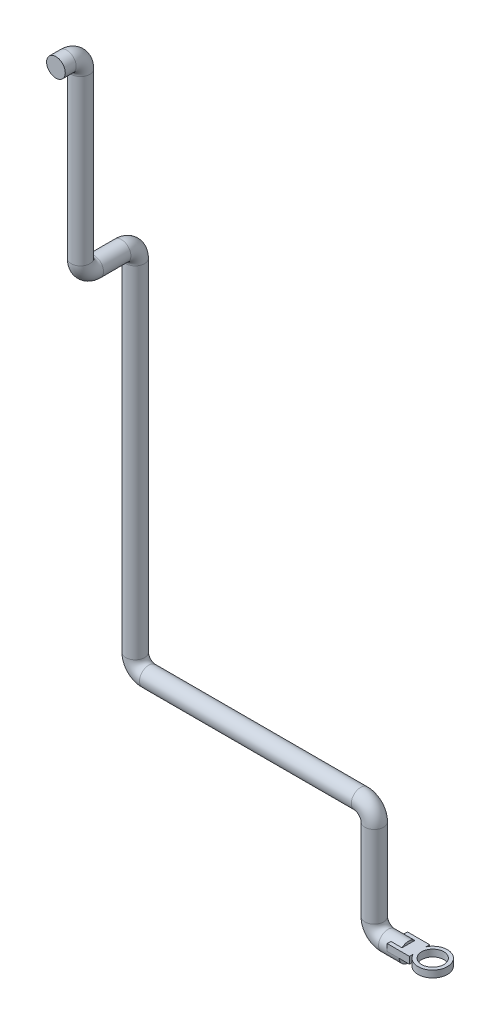
ISO-10303-21;
HEADER;
FILE_DESCRIPTION(('STEP AP214'),'2;1');
FILE_NAME('part.step','',(''),(''),'','','');
FILE_SCHEMA(('AUTOMOTIVE_DESIGN { 1 0 10303 214 1 1 1 1 }'));
ENDSEC;
DATA;
#1=APPLICATION_CONTEXT('core data for automotive mechanical design processes');
#2=APPLICATION_PROTOCOL_DEFINITION('international standard','automotive_design',2000,#1);
#3=PRODUCT_CONTEXT('',#1,'mechanical');
#4=PRODUCT('Part','Part','',(#3));
#5=PRODUCT_RELATED_PRODUCT_CATEGORY('part','',(#4));
#6=PRODUCT_DEFINITION_FORMATION('','',#4);
#7=PRODUCT_DEFINITION_CONTEXT('part definition',#1,'design');
#8=PRODUCT_DEFINITION('design','',#6,#7);
#9=PRODUCT_DEFINITION_SHAPE('','',#8);
#10=(LENGTH_UNIT() NAMED_UNIT(*) SI_UNIT(.MILLI.,.METRE.));
#11=(NAMED_UNIT(*) PLANE_ANGLE_UNIT() SI_UNIT($,.RADIAN.));
#12=(NAMED_UNIT(*) SI_UNIT($,.STERADIAN.) SOLID_ANGLE_UNIT());
#13=UNCERTAINTY_MEASURE_WITH_UNIT(LENGTH_MEASURE(1.E-05),#10,'distance_accuracy_value','');
#14=(GEOMETRIC_REPRESENTATION_CONTEXT(3) GLOBAL_UNCERTAINTY_ASSIGNED_CONTEXT((#13)) GLOBAL_UNIT_ASSIGNED_CONTEXT((#10,
#11,#12)) REPRESENTATION_CONTEXT('',''));
#15=CARTESIAN_POINT('',(0.,0.,0.));
#16=DIRECTION('',(0.,0.,1.));
#17=DIRECTION('',(1.,0.,0.));
#18=AXIS2_PLACEMENT_3D('',#15,#16,#17);
#19=CARTESIAN_POINT('',(0.,0.,0.));
#20=DIRECTION('',(1.,0.,0.));
#21=DIRECTION('',(0.,0.,-1.));
#22=AXIS2_PLACEMENT_3D('',#19,#20,#21);
#23=PLANE('',#22);
#24=CARTESIAN_POINT('',(0.,0.,0.));
#25=DIRECTION('',(1.,0.,0.));
#26=DIRECTION('',(0.,0.,-1.));
#27=AXIS2_PLACEMENT_3D('',#24,#25,#26);
#28=CIRCLE('',#27,13.7);
#29=CARTESIAN_POINT('',(0.,0.,13.7));
#30=VERTEX_POINT('',#29);
#31=CARTESIAN_POINT('',(0.,0.,-13.7));
#32=VERTEX_POINT('',#31);
#33=EDGE_CURVE('E185',#30,#32,#28,.T.);
#34=ORIENTED_EDGE('',*,*,#33,.T.);
#35=DIRECTION('',(0.,0.,1.));
#36=VECTOR('',#35,1.);
#37=CARTESIAN_POINT('',(0.,0.,0.));
#38=LINE('',#37,#36);
#39=EDGE_CURVE('E122',#32,#30,#38,.T.);
#40=ORIENTED_EDGE('',*,*,#39,.T.);
#41=EDGE_LOOP('',(#34,#40));
#42=FACE_BOUND('',#41,.T.);
#43=ADVANCED_FACE('F36',(#42),#23,.T.);
#44=DIRECTION('',(0.,0.,1.));
#45=VECTOR('',#44,1.);
#46=CARTESIAN_POINT('',(0.,10.,0.));
#47=LINE('',#46,#45);
#48=CARTESIAN_POINT('',(0.,10.,-9.36429388688757));
#49=VERTEX_POINT('',#48);
#50=CARTESIAN_POINT('',(0.,10.,9.36429388688757));
#51=VERTEX_POINT('',#50);
#52=EDGE_CURVE('E182',#49,#51,#47,.T.);
#53=ORIENTED_EDGE('',*,*,#52,.F.);
#54=EDGE_CURVE('E188',#49,#51,#28,.T.);
#55=ORIENTED_EDGE('',*,*,#54,.T.);
#56=EDGE_LOOP('',(#53,#55));
#57=FACE_BOUND('',#56,.T.);
#58=ADVANCED_FACE('F38',(#57),#23,.T.);
#59=CARTESIAN_POINT('',(-400.,979.4,116.));
#60=DIRECTION('',(0.,0.,-1.));
#61=DIRECTION('',(0.,1.,0.));
#62=AXIS2_PLACEMENT_3D('',#59,#60,#61);
#63=PLANE('',#62);
#64=CARTESIAN_POINT('',(-400.,979.4,116.));
#65=DIRECTION('',(0.,0.,-1.));
#66=DIRECTION('',(0.,1.,0.));
#67=AXIS2_PLACEMENT_3D('',#64,#65,#66);
#68=CIRCLE('',#67,13.7);
#69=CARTESIAN_POINT('',(-400.,993.1,116.));
#70=VERTEX_POINT('',#69);
#71=EDGE_CURVE('E225',#70,#70,#68,.T.);
#72=ORIENTED_EDGE('',*,*,#71,.F.);
#73=EDGE_LOOP('',(#72));
#74=FACE_BOUND('',#73,.T.);
#75=ADVANCED_FACE('F264',(#74),#63,.F.);
#76=CARTESIAN_POINT('',(0.,0.,0.));
#77=DIRECTION('',(-1.,0.,0.));
#78=DIRECTION('',(0.,0.,1.));
#79=AXIS2_PLACEMENT_3D('',#76,#77,#78);
#80=CYLINDRICAL_SURFACE('',#79,13.7);
#81=CARTESIAN_POINT('',(-30.,0.,0.));
#82=DIRECTION('',(1.,0.,0.));
#83=DIRECTION('',(0.,0.,-1.));
#84=AXIS2_PLACEMENT_3D('',#81,#82,#83);
#85=CIRCLE('',#84,13.7);
#86=CARTESIAN_POINT('',(-30.,-13.7,0.));
#87=VERTEX_POINT('',#86);
#88=EDGE_CURVE('E189',#87,#87,#85,.T.);
#89=ORIENTED_EDGE('',*,*,#88,.T.);
#90=EDGE_LOOP('',(#89));
#91=FACE_BOUND('',#90,.T.);
#92=ORIENTED_EDGE('',*,*,#54,.F.);
#93=DIRECTION('',(-1.,0.,0.));
#94=VECTOR('',#93,1.);
#95=CARTESIAN_POINT('',(0.,10.,-9.36429388688757));
#96=LINE('',#95,#94);
#97=CARTESIAN_POINT('',(-16.2659327761707,10.,-9.36429388688757));
#98=VERTEX_POINT('',#97);
#99=EDGE_CURVE('E11',#49,#98,#96,.T.);
#100=ORIENTED_EDGE('',*,*,#99,.T.);
#101=CARTESIAN_POINT('',(-16.2659327761707,0.,0.));
#102=DIRECTION('',(1.,0.,0.));
#103=DIRECTION('',(0.,0.,-1.));
#104=AXIS2_PLACEMENT_3D('',#101,#102,#103);
#105=CIRCLE('',#104,13.7);
#106=CARTESIAN_POINT('',(-16.2659327761707,0.,-13.7));
#107=VERTEX_POINT('',#106);
#108=EDGE_CURVE('E44',#107,#98,#105,.T.);
#109=ORIENTED_EDGE('',*,*,#108,.F.);
#110=DIRECTION('',(-1.,0.,0.));
#111=VECTOR('',#110,1.);
#112=CARTESIAN_POINT('',(0.,0.,-13.7));
#113=LINE('',#112,#111);
#114=EDGE_CURVE('E234',#32,#107,#113,.T.);
#115=ORIENTED_EDGE('',*,*,#114,.F.);
#116=ORIENTED_EDGE('',*,*,#33,.F.);
#117=DIRECTION('',(-1.,0.,0.));
#118=VECTOR('',#117,1.);
#119=CARTESIAN_POINT('',(0.,0.,13.7));
#120=LINE('',#119,#118);
#121=CARTESIAN_POINT('',(-16.2659327761707,0.,13.7));
#122=VERTEX_POINT('',#121);
#123=EDGE_CURVE('E227',#122,#30,#120,.F.);
#124=ORIENTED_EDGE('',*,*,#123,.F.);
#125=CARTESIAN_POINT('',(-16.2659327761707,10.,9.36429388688757));
#126=VERTEX_POINT('',#125);
#127=EDGE_CURVE('E230',#126,#122,#105,.T.);
#128=ORIENTED_EDGE('',*,*,#127,.F.);
#129=DIRECTION('',(-1.,0.,0.));
#130=VECTOR('',#129,1.);
#131=CARTESIAN_POINT('',(0.,10.,9.36429388688757));
#132=LINE('',#131,#130);
#133=EDGE_CURVE('E233',#126,#51,#132,.F.);
#134=ORIENTED_EDGE('',*,*,#133,.T.);
#135=EDGE_LOOP('',(#92,#100,#109,#115,#116,#124,#128,#134));
#136=FACE_BOUND('',#135,.T.);
#137=ADVANCED_FACE('F281',(#91,#136),#80,.T.);
#138=CARTESIAN_POINT('',(-30.,20.,0.));
#139=DIRECTION('',(0.,0.,-1.));
#140=DIRECTION('',(-1.,0.,0.));
#141=AXIS2_PLACEMENT_3D('',#138,#139,#140);
#142=TOROIDAL_SURFACE('',#141,20.,13.7);
#143=CARTESIAN_POINT('',(-50.,20.,0.));
#144=DIRECTION('',(0.,-1.,0.));
#145=DIRECTION('',(0.,0.,-1.));
#146=AXIS2_PLACEMENT_3D('',#143,#144,#145);
#147=CIRCLE('',#146,13.7);
#148=CARTESIAN_POINT('',(-63.7,20.,0.));
#149=VERTEX_POINT('',#148);
#150=EDGE_CURVE('E192',#149,#149,#147,.T.);
#151=CARTESIAN_POINT('',(-30.,20.,0.));
#152=DIRECTION('',(0.,0.,-1.));
#153=DIRECTION('',(-1.,0.,0.));
#154=AXIS2_PLACEMENT_3D('',#151,#152,#153);
#155=CIRCLE('',#154,33.7);
#156=EDGE_CURVE('',#87,#149,#155,.T.);
#157=ORIENTED_EDGE('',*,*,#88,.F.);
#158=ORIENTED_EDGE('',*,*,#150,.T.);
#159=ORIENTED_EDGE('',*,*,#156,.T.);
#160=ORIENTED_EDGE('',*,*,#156,.F.);
#161=EDGE_LOOP('',(#157,#159,#158,#160));
#162=FACE_BOUND('',#161,.T.);
#163=ADVANCED_FACE('F286',(#162),#142,.T.);
#164=CARTESIAN_POINT('',(-50.,20.,0.));
#165=DIRECTION('',(0.,1.,0.));
#166=DIRECTION('',(0.,0.,1.));
#167=AXIS2_PLACEMENT_3D('',#164,#165,#166);
#168=CYLINDRICAL_SURFACE('',#167,13.7);
#169=CARTESIAN_POINT('',(-50.,140.,0.));
#170=DIRECTION('',(0.,-1.,0.));
#171=DIRECTION('',(0.,0.,-1.));
#172=AXIS2_PLACEMENT_3D('',#169,#170,#171);
#173=CIRCLE('',#172,13.7);
#174=CARTESIAN_POINT('',(-36.3,140.,0.));
#175=VERTEX_POINT('',#174);
#176=EDGE_CURVE('E195',#175,#175,#173,.T.);
#177=ORIENTED_EDGE('',*,*,#176,.T.);
#178=EDGE_LOOP('',(#177));
#179=FACE_BOUND('',#178,.T.);
#180=ORIENTED_EDGE('',*,*,#150,.F.);
#181=EDGE_LOOP('',(#180));
#182=FACE_BOUND('',#181,.T.);
#183=ADVANCED_FACE('F293',(#179,#182),#168,.T.);
#184=CARTESIAN_POINT('',(-70.,140.,0.));
#185=DIRECTION('',(0.,0.,1.));
#186=DIRECTION('',(1.,0.,0.));
#187=AXIS2_PLACEMENT_3D('',#184,#185,#186);
#188=TOROIDAL_SURFACE('',#187,20.,13.7);
#189=CARTESIAN_POINT('',(-70.,160.,0.));
#190=DIRECTION('',(1.,0.,0.));
#191=DIRECTION('',(0.,0.,-1.));
#192=AXIS2_PLACEMENT_3D('',#189,#190,#191);
#193=CIRCLE('',#192,13.7);
#194=CARTESIAN_POINT('',(-70.,173.7,0.));
#195=VERTEX_POINT('',#194);
#196=EDGE_CURVE('E198',#195,#195,#193,.T.);
#197=CARTESIAN_POINT('',(-70.,140.,0.));
#198=DIRECTION('',(0.,0.,1.));
#199=DIRECTION('',(1.,0.,0.));
#200=AXIS2_PLACEMENT_3D('',#197,#198,#199);
#201=CIRCLE('',#200,33.7);
#202=EDGE_CURVE('',#175,#195,#201,.T.);
#203=ORIENTED_EDGE('',*,*,#176,.F.);
#204=ORIENTED_EDGE('',*,*,#196,.T.);
#205=ORIENTED_EDGE('',*,*,#202,.T.);
#206=ORIENTED_EDGE('',*,*,#202,.F.);
#207=EDGE_LOOP('',(#203,#205,#204,#206));
#208=FACE_BOUND('',#207,.T.);
#209=ADVANCED_FACE('F300',(#208),#188,.T.);
#210=CARTESIAN_POINT('',(-70.,160.,0.));
#211=DIRECTION('',(-1.,0.,0.));
#212=DIRECTION('',(0.,0.,1.));
#213=AXIS2_PLACEMENT_3D('',#210,#211,#212);
#214=CYLINDRICAL_SURFACE('',#213,13.7);
#215=CARTESIAN_POINT('',(-380.,160.,0.));
#216=DIRECTION('',(1.,0.,0.));
#217=DIRECTION('',(0.,0.,-1.));
#218=AXIS2_PLACEMENT_3D('',#215,#216,#217);
#219=CIRCLE('',#218,13.7);
#220=CARTESIAN_POINT('',(-380.,146.3,0.));
#221=VERTEX_POINT('',#220);
#222=EDGE_CURVE('E201',#221,#221,#219,.T.);
#223=ORIENTED_EDGE('',*,*,#222,.T.);
#224=EDGE_LOOP('',(#223));
#225=FACE_BOUND('',#224,.T.);
#226=ORIENTED_EDGE('',*,*,#196,.F.);
#227=EDGE_LOOP('',(#226));
#228=FACE_BOUND('',#227,.T.);
#229=ADVANCED_FACE('F304',(#225,#228),#214,.T.);
#230=CARTESIAN_POINT('',(-380.,180.,0.));
#231=DIRECTION('',(0.,0.,-1.));
#232=DIRECTION('',(-1.,0.,0.));
#233=AXIS2_PLACEMENT_3D('',#230,#231,#232);
#234=TOROIDAL_SURFACE('',#233,20.,13.7);
#235=CARTESIAN_POINT('',(-400.,180.,0.));
#236=DIRECTION('',(0.,-1.,0.));
#237=DIRECTION('',(0.,0.,-1.));
#238=AXIS2_PLACEMENT_3D('',#235,#236,#237);
#239=CIRCLE('',#238,13.7);
#240=CARTESIAN_POINT('',(-413.7,180.,0.));
#241=VERTEX_POINT('',#240);
#242=EDGE_CURVE('E204',#241,#241,#239,.T.);
#243=CARTESIAN_POINT('',(-380.,180.,0.));
#244=DIRECTION('',(0.,0.,-1.));
#245=DIRECTION('',(-1.,0.,0.));
#246=AXIS2_PLACEMENT_3D('',#243,#244,#245);
#247=CIRCLE('',#246,33.7);
#248=EDGE_CURVE('',#221,#241,#247,.T.);
#249=ORIENTED_EDGE('',*,*,#222,.F.);
#250=ORIENTED_EDGE('',*,*,#242,.T.);
#251=ORIENTED_EDGE('',*,*,#248,.T.);
#252=ORIENTED_EDGE('',*,*,#248,.F.);
#253=EDGE_LOOP('',(#249,#251,#250,#252));
#254=FACE_BOUND('',#253,.T.);
#255=ADVANCED_FACE('F308',(#254),#234,.T.);
#256=CARTESIAN_POINT('',(-400.,180.,0.));
#257=DIRECTION('',(0.,1.,0.));
#258=DIRECTION('',(0.,0.,1.));
#259=AXIS2_PLACEMENT_3D('',#256,#257,#258);
#260=CYLINDRICAL_SURFACE('',#259,13.7);
#261=CARTESIAN_POINT('',(-400.,679.4,0.));
#262=DIRECTION('',(0.,-1.,0.));
#263=DIRECTION('',(0.,0.,-1.));
#264=AXIS2_PLACEMENT_3D('',#261,#262,#263);
#265=CIRCLE('',#264,13.7);
#266=CARTESIAN_POINT('',(-400.,679.4,-13.7));
#267=VERTEX_POINT('',#266);
#268=EDGE_CURVE('E207',#267,#267,#265,.T.);
#269=ORIENTED_EDGE('',*,*,#268,.T.);
#270=EDGE_LOOP('',(#269));
#271=FACE_BOUND('',#270,.T.);
#272=ORIENTED_EDGE('',*,*,#242,.F.);
#273=EDGE_LOOP('',(#272));
#274=FACE_BOUND('',#273,.T.);
#275=ADVANCED_FACE('F312',(#271,#274),#260,.T.);
#276=CARTESIAN_POINT('',(-400.,679.4,20.));
#277=DIRECTION('',(1.,0.,0.));
#278=DIRECTION('',(0.,0.,-1.));
#279=AXIS2_PLACEMENT_3D('',#276,#277,#278);
#280=TOROIDAL_SURFACE('',#279,20.,13.7);
#281=CARTESIAN_POINT('',(-400.,699.4,20.));
#282=DIRECTION('',(0.,0.,-1.));
#283=DIRECTION('',(0.,1.,0.));
#284=AXIS2_PLACEMENT_3D('',#281,#282,#283);
#285=CIRCLE('',#284,13.7);
#286=CARTESIAN_POINT('',(-400.,713.1,20.));
#287=VERTEX_POINT('',#286);
#288=EDGE_CURVE('E210',#287,#287,#285,.T.);
#289=CARTESIAN_POINT('',(-400.,679.4,20.));
#290=DIRECTION('',(1.,0.,0.));
#291=DIRECTION('',(0.,0.,-1.));
#292=AXIS2_PLACEMENT_3D('',#289,#290,#291);
#293=CIRCLE('',#292,33.7);
#294=EDGE_CURVE('',#267,#287,#293,.T.);
#295=ORIENTED_EDGE('',*,*,#268,.F.);
#296=ORIENTED_EDGE('',*,*,#288,.T.);
#297=ORIENTED_EDGE('',*,*,#294,.T.);
#298=ORIENTED_EDGE('',*,*,#294,.F.);
#299=EDGE_LOOP('',(#295,#297,#296,#298));
#300=FACE_BOUND('',#299,.T.);
#301=ADVANCED_FACE('F316',(#300),#280,.T.);
#302=CARTESIAN_POINT('',(-400.,699.4,20.));
#303=DIRECTION('',(0.,0.,1.));
#304=DIRECTION('',(1.,0.,0.));
#305=AXIS2_PLACEMENT_3D('',#302,#303,#304);
#306=CYLINDRICAL_SURFACE('',#305,13.7);
#307=CARTESIAN_POINT('',(-400.,699.4,60.));
#308=DIRECTION('',(0.,0.,-1.));
#309=DIRECTION('',(0.,1.,0.));
#310=AXIS2_PLACEMENT_3D('',#307,#308,#309);
#311=CIRCLE('',#310,13.7);
#312=CARTESIAN_POINT('',(-400.,685.7,60.));
#313=VERTEX_POINT('',#312);
#314=EDGE_CURVE('E213',#313,#313,#311,.T.);
#315=ORIENTED_EDGE('',*,*,#314,.T.);
#316=EDGE_LOOP('',(#315));
#317=FACE_BOUND('',#316,.T.);
#318=ORIENTED_EDGE('',*,*,#288,.F.);
#319=EDGE_LOOP('',(#318));
#320=FACE_BOUND('',#319,.T.);
#321=ADVANCED_FACE('F320',(#317,#320),#306,.T.);
#322=CARTESIAN_POINT('',(-400.,719.4,60.));
#323=DIRECTION('',(-1.,0.,0.));
#324=DIRECTION('',(0.,0.,1.));
#325=AXIS2_PLACEMENT_3D('',#322,#323,#324);
#326=TOROIDAL_SURFACE('',#325,20.,13.7);
#327=CARTESIAN_POINT('',(-400.,719.4,80.));
#328=DIRECTION('',(0.,-1.,0.));
#329=DIRECTION('',(0.,0.,-1.));
#330=AXIS2_PLACEMENT_3D('',#327,#328,#329);
#331=CIRCLE('',#330,13.7);
#332=CARTESIAN_POINT('',(-400.,719.4,93.7));
#333=VERTEX_POINT('',#332);
#334=EDGE_CURVE('E216',#333,#333,#331,.T.);
#335=CARTESIAN_POINT('',(-400.,719.4,60.));
#336=DIRECTION('',(-1.,0.,0.));
#337=DIRECTION('',(0.,0.,1.));
#338=AXIS2_PLACEMENT_3D('',#335,#336,#337);
#339=CIRCLE('',#338,33.7);
#340=EDGE_CURVE('',#313,#333,#339,.T.);
#341=ORIENTED_EDGE('',*,*,#314,.F.);
#342=ORIENTED_EDGE('',*,*,#334,.T.);
#343=ORIENTED_EDGE('',*,*,#340,.T.);
#344=ORIENTED_EDGE('',*,*,#340,.F.);
#345=EDGE_LOOP('',(#341,#343,#342,#344));
#346=FACE_BOUND('',#345,.T.);
#347=ADVANCED_FACE('F324',(#346),#326,.T.);
#348=CARTESIAN_POINT('',(-400.,719.4,80.));
#349=DIRECTION('',(0.,1.,0.));
#350=DIRECTION('',(0.,0.,1.));
#351=AXIS2_PLACEMENT_3D('',#348,#349,#350);
#352=CYLINDRICAL_SURFACE('',#351,13.7);
#353=CARTESIAN_POINT('',(-400.,959.4,80.));
#354=DIRECTION('',(0.,-1.,0.));
#355=DIRECTION('',(0.,0.,-1.));
#356=AXIS2_PLACEMENT_3D('',#353,#354,#355);
#357=CIRCLE('',#356,13.7);
#358=CARTESIAN_POINT('',(-400.,959.4,66.3));
#359=VERTEX_POINT('',#358);
#360=EDGE_CURVE('E219',#359,#359,#357,.T.);
#361=ORIENTED_EDGE('',*,*,#360,.T.);
#362=EDGE_LOOP('',(#361));
#363=FACE_BOUND('',#362,.T.);
#364=ORIENTED_EDGE('',*,*,#334,.F.);
#365=EDGE_LOOP('',(#364));
#366=FACE_BOUND('',#365,.T.);
#367=ADVANCED_FACE('F275',(#363,#366),#352,.T.);
#368=CARTESIAN_POINT('',(-400.,959.4,100.));
#369=DIRECTION('',(1.,0.,0.));
#370=DIRECTION('',(0.,0.,-1.));
#371=AXIS2_PLACEMENT_3D('',#368,#369,#370);
#372=TOROIDAL_SURFACE('',#371,20.,13.7);
#373=CARTESIAN_POINT('',(-400.,979.4,100.));
#374=DIRECTION('',(0.,0.,-1.));
#375=DIRECTION('',(0.,1.,0.));
#376=AXIS2_PLACEMENT_3D('',#373,#374,#375);
#377=CIRCLE('',#376,13.7);
#378=CARTESIAN_POINT('',(-400.,993.1,100.));
#379=VERTEX_POINT('',#378);
#380=EDGE_CURVE('E222',#379,#379,#377,.T.);
#381=CARTESIAN_POINT('',(-400.,959.4,100.));
#382=DIRECTION('',(1.,0.,0.));
#383=DIRECTION('',(0.,0.,-1.));
#384=AXIS2_PLACEMENT_3D('',#381,#382,#383);
#385=CIRCLE('',#384,33.7);
#386=EDGE_CURVE('',#359,#379,#385,.T.);
#387=ORIENTED_EDGE('',*,*,#360,.F.);
#388=ORIENTED_EDGE('',*,*,#380,.T.);
#389=ORIENTED_EDGE('',*,*,#386,.T.);
#390=ORIENTED_EDGE('',*,*,#386,.F.);
#391=EDGE_LOOP('',(#387,#389,#388,#390));
#392=FACE_BOUND('',#391,.T.);
#393=ADVANCED_FACE('F267',(#392),#372,.T.);
#394=CARTESIAN_POINT('',(-400.,979.4,100.));
#395=DIRECTION('',(0.,0.,1.));
#396=DIRECTION('',(1.,0.,0.));
#397=AXIS2_PLACEMENT_3D('',#394,#395,#396);
#398=CYLINDRICAL_SURFACE('',#397,13.7);
#399=ORIENTED_EDGE('',*,*,#71,.T.);
#400=EDGE_LOOP('',(#399));
#401=FACE_BOUND('',#400,.T.);
#402=ORIENTED_EDGE('',*,*,#380,.F.);
#403=EDGE_LOOP('',(#402));
#404=FACE_BOUND('',#403,.T.);
#405=ADVANCED_FACE('F260',(#401,#404),#398,.T.);
#406=CARTESIAN_POINT('',(-16.2659327761707,10.,0.));
#407=DIRECTION('',(1.,0.,0.));
#408=DIRECTION('',(0.,0.,-1.));
#409=AXIS2_PLACEMENT_3D('',#406,#407,#408);
#410=PLANE('',#409);
#411=DIRECTION('',(0.,0.,1.));
#412=VECTOR('',#411,1.);
#413=CARTESIAN_POINT('',(-16.2659327761707,0.,0.));
#414=LINE('',#413,#412);
#415=CARTESIAN_POINT('',(-16.2659327761707,0.,-14.786933087508));
#416=VERTEX_POINT('',#415);
#417=EDGE_CURVE('E166',#416,#107,#414,.T.);
#418=ORIENTED_EDGE('',*,*,#417,.T.);
#419=ORIENTED_EDGE('',*,*,#108,.T.);
#420=DIRECTION('',(0.,0.,1.));
#421=VECTOR('',#420,1.);
#422=CARTESIAN_POINT('',(-16.2659327761707,10.,0.));
#423=LINE('',#422,#421);
#424=CARTESIAN_POINT('',(-16.2659327761707,10.,-14.786933087508));
#425=VERTEX_POINT('',#424);
#426=EDGE_CURVE('E148',#425,#98,#423,.T.);
#427=ORIENTED_EDGE('',*,*,#426,.F.);
#428=DIRECTION('',(0.,-1.,0.));
#429=VECTOR('',#428,1.);
#430=CARTESIAN_POINT('',(-16.2659327761707,10.,-14.786933087508));
#431=LINE('',#430,#429);
#432=EDGE_CURVE('E175',#425,#416,#431,.T.);
#433=ORIENTED_EDGE('',*,*,#432,.T.);
#434=EDGE_LOOP('',(#418,#419,#427,#433));
#435=FACE_BOUND('',#434,.T.);
#436=ADVANCED_FACE('F240',(#435),#410,.F.);
#437=CARTESIAN_POINT('',(0.,10.,0.));
#438=DIRECTION('',(0.,1.,0.));
#439=DIRECTION('',(0.,0.,1.));
#440=AXIS2_PLACEMENT_3D('',#437,#438,#439);
#441=PLANE('',#440);
#442=CARTESIAN_POINT('',(35.5661147738134,10.,0.));
#443=DIRECTION('',(0.,1.,0.));
#444=DIRECTION('',(0.,0.,1.));
#445=AXIS2_PLACEMENT_3D('',#442,#443,#444);
#446=CIRCLE('',#445,16.2372737658734);
#447=CARTESIAN_POINT('',(35.5661147738134,10.,16.2372737658734));
#448=VERTEX_POINT('',#447);
#449=EDGE_CURVE('E152',#448,#448,#446,.T.);
#450=ORIENTED_EDGE('',*,*,#449,.F.);
#451=EDGE_LOOP('',(#450));
#452=FACE_BOUND('',#451,.T.);
#453=ORIENTED_EDGE('',*,*,#99,.F.);
#454=ORIENTED_EDGE('',*,*,#52,.T.);
#455=ORIENTED_EDGE('',*,*,#133,.F.);
#456=CARTESIAN_POINT('',(-16.2659327761707,10.,14.786933087508));
#457=VERTEX_POINT('',#456);
#458=EDGE_CURVE('E147',#126,#457,#423,.T.);
#459=ORIENTED_EDGE('',*,*,#458,.T.);
#460=DIRECTION('',(1.,0.,0.));
#461=VECTOR('',#460,1.);
#462=CARTESIAN_POINT('',(0.,10.,14.786933087508));
#463=LINE('',#462,#461);
#464=CARTESIAN_POINT('',(16.2659327761707,10.,14.786933087508));
#465=VERTEX_POINT('',#464);
#466=EDGE_CURVE('E135',#457,#465,#463,.T.);
#467=ORIENTED_EDGE('',*,*,#466,.T.);
#468=DIRECTION('',(0.,0.,1.));
#469=VECTOR('',#468,1.);
#470=CARTESIAN_POINT('',(16.2659327761707,10.,0.));
#471=LINE('',#470,#469);
#472=CARTESIAN_POINT('',(16.2659327761707,10.,9.41237702546233));
#473=VERTEX_POINT('',#472);
#474=EDGE_CURVE('E116',#473,#465,#471,.T.);
#475=ORIENTED_EDGE('',*,*,#474,.F.);
#476=CARTESIAN_POINT('',(35.5661147738134,10.,0.));
#477=DIRECTION('',(0.,1.,0.));
#478=DIRECTION('',(0.,0.,1.));
#479=AXIS2_PLACEMENT_3D('',#476,#477,#478);
#480=CIRCLE('',#479,21.4730031996361);
#481=CARTESIAN_POINT('',(16.2659327761707,10.,-9.41237702546233));
#482=VERTEX_POINT('',#481);
#483=EDGE_CURVE('E126',#473,#482,#480,.T.);
#484=ORIENTED_EDGE('',*,*,#483,.T.);
#485=DIRECTION('',(0.,0.,1.));
#486=VECTOR('',#485,1.);
#487=CARTESIAN_POINT('',(16.2659327761707,10.,0.));
#488=LINE('',#487,#486);
#489=CARTESIAN_POINT('',(16.2659327761707,10.,-14.786933087508));
#490=VERTEX_POINT('',#489);
#491=EDGE_CURVE('E131',#490,#482,#488,.T.);
#492=ORIENTED_EDGE('',*,*,#491,.F.);
#493=DIRECTION('',(1.,0.,0.));
#494=VECTOR('',#493,1.);
#495=CARTESIAN_POINT('',(0.,10.,-14.786933087508));
#496=LINE('',#495,#494);
#497=EDGE_CURVE('E144',#425,#490,#496,.T.);
#498=ORIENTED_EDGE('',*,*,#497,.F.);
#499=ORIENTED_EDGE('',*,*,#426,.T.);
#500=EDGE_LOOP('',(#453,#454,#455,#459,#467,#475,#484,#492,#498,#499));
#501=FACE_BOUND('',#500,.T.);
#502=ADVANCED_FACE('F133',(#452,#501),#441,.T.);
#503=CARTESIAN_POINT('',(0.,0.,0.));
#504=DIRECTION('',(0.,1.,0.));
#505=DIRECTION('',(0.,0.,1.));
#506=AXIS2_PLACEMENT_3D('',#503,#504,#505);
#507=PLANE('',#506);
#508=CARTESIAN_POINT('',(35.5661147738134,0.,0.));
#509=DIRECTION('',(0.,1.,0.));
#510=DIRECTION('',(0.,0.,1.));
#511=AXIS2_PLACEMENT_3D('',#508,#509,#510);
#512=CIRCLE('',#511,16.2372737658734);
#513=CARTESIAN_POINT('',(35.5661147738134,0.,16.2372737658734));
#514=VERTEX_POINT('',#513);
#515=EDGE_CURVE('E137',#514,#514,#512,.T.);
#516=ORIENTED_EDGE('',*,*,#515,.T.);
#517=EDGE_LOOP('',(#516));
#518=FACE_BOUND('',#517,.T.);
#519=ORIENTED_EDGE('',*,*,#39,.F.);
#520=ORIENTED_EDGE('',*,*,#114,.T.);
#521=ORIENTED_EDGE('',*,*,#417,.F.);
#522=DIRECTION('',(1.,0.,0.));
#523=VECTOR('',#522,1.);
#524=CARTESIAN_POINT('',(0.,0.,-14.786933087508));
#525=LINE('',#524,#523);
#526=CARTESIAN_POINT('',(16.2659327761707,0.,-14.786933087508));
#527=VERTEX_POINT('',#526);
#528=EDGE_CURVE('E162',#416,#527,#525,.T.);
#529=ORIENTED_EDGE('',*,*,#528,.T.);
#530=DIRECTION('',(0.,0.,1.));
#531=VECTOR('',#530,1.);
#532=CARTESIAN_POINT('',(16.2659327761707,0.,0.));
#533=LINE('',#532,#531);
#534=CARTESIAN_POINT('',(16.2659327761707,0.,-9.41237702546233));
#535=VERTEX_POINT('',#534);
#536=EDGE_CURVE('E159',#527,#535,#533,.T.);
#537=ORIENTED_EDGE('',*,*,#536,.T.);
#538=CARTESIAN_POINT('',(35.5661147738134,0.,0.));
#539=DIRECTION('',(0.,1.,0.));
#540=DIRECTION('',(0.,0.,1.));
#541=AXIS2_PLACEMENT_3D('',#538,#539,#540);
#542=CIRCLE('',#541,21.4730031996361);
#543=CARTESIAN_POINT('',(16.2659327761707,0.,9.41237702546233));
#544=VERTEX_POINT('',#543);
#545=EDGE_CURVE('E157',#544,#535,#542,.T.);
#546=ORIENTED_EDGE('',*,*,#545,.F.);
#547=DIRECTION('',(0.,0.,1.));
#548=VECTOR('',#547,1.);
#549=CARTESIAN_POINT('',(16.2659327761707,0.,0.));
#550=LINE('',#549,#548);
#551=CARTESIAN_POINT('',(16.2659327761707,0.,14.786933087508));
#552=VERTEX_POINT('',#551);
#553=EDGE_CURVE('E118',#544,#552,#550,.T.);
#554=ORIENTED_EDGE('',*,*,#553,.T.);
#555=DIRECTION('',(1.,0.,0.));
#556=VECTOR('',#555,1.);
#557=CARTESIAN_POINT('',(0.,0.,14.786933087508));
#558=LINE('',#557,#556);
#559=CARTESIAN_POINT('',(-16.2659327761707,0.,14.786933087508));
#560=VERTEX_POINT('',#559);
#561=EDGE_CURVE('E140',#560,#552,#558,.T.);
#562=ORIENTED_EDGE('',*,*,#561,.F.);
#563=EDGE_CURVE('E165',#122,#560,#414,.T.);
#564=ORIENTED_EDGE('',*,*,#563,.F.);
#565=ORIENTED_EDGE('',*,*,#123,.T.);
#566=EDGE_LOOP('',(#519,#520,#521,#529,#537,#546,#554,#562,#564,#565));
#567=FACE_BOUND('',#566,.T.);
#568=ADVANCED_FACE('F246',(#518,#567),#507,.F.);
#569=CARTESIAN_POINT('',(16.2659327761707,10.,0.));
#570=DIRECTION('',(1.,0.,0.));
#571=DIRECTION('',(0.,0.,-1.));
#572=AXIS2_PLACEMENT_3D('',#569,#570,#571);
#573=PLANE('',#572);
#574=ORIENTED_EDGE('',*,*,#553,.F.);
#575=DIRECTION('',(0.,-1.,0.));
#576=VECTOR('',#575,1.);
#577=CARTESIAN_POINT('',(16.2659327761707,10.,9.41237702546233));
#578=LINE('',#577,#576);
#579=EDGE_CURVE('E112',#473,#544,#578,.T.);
#580=ORIENTED_EDGE('',*,*,#579,.F.);
#581=ORIENTED_EDGE('',*,*,#474,.T.);
#582=DIRECTION('',(0.,-1.,0.));
#583=VECTOR('',#582,1.);
#584=CARTESIAN_POINT('',(16.2659327761707,10.,14.786933087508));
#585=LINE('',#584,#583);
#586=EDGE_CURVE('E155',#465,#552,#585,.T.);
#587=ORIENTED_EDGE('',*,*,#586,.T.);
#588=EDGE_LOOP('',(#574,#580,#581,#587));
#589=FACE_BOUND('',#588,.T.);
#590=ADVANCED_FACE('F114',(#589),#573,.T.);
#591=CARTESIAN_POINT('',(35.5661147738134,10.,0.));
#592=DIRECTION('',(0.,-1.,0.));
#593=DIRECTION('',(0.,0.,-1.));
#594=AXIS2_PLACEMENT_3D('',#591,#592,#593);
#595=CYLINDRICAL_SURFACE('',#594,21.4730031996361);
#596=ORIENTED_EDGE('',*,*,#545,.T.);
#597=DIRECTION('',(0.,-1.,0.));
#598=VECTOR('',#597,1.);
#599=CARTESIAN_POINT('',(16.2659327761707,10.,-9.41237702546233));
#600=LINE('',#599,#598);
#601=EDGE_CURVE('E123',#482,#535,#600,.T.);
#602=ORIENTED_EDGE('',*,*,#601,.F.);
#603=ORIENTED_EDGE('',*,*,#483,.F.);
#604=ORIENTED_EDGE('',*,*,#579,.T.);
#605=EDGE_LOOP('',(#596,#602,#603,#604));
#606=FACE_BOUND('',#605,.T.);
#607=ADVANCED_FACE('F127',(#606),#595,.T.);
#608=CARTESIAN_POINT('',(16.2659327761707,10.,0.));
#609=DIRECTION('',(1.,0.,0.));
#610=DIRECTION('',(0.,0.,-1.));
#611=AXIS2_PLACEMENT_3D('',#608,#609,#610);
#612=PLANE('',#611);
#613=ORIENTED_EDGE('',*,*,#536,.F.);
#614=DIRECTION('',(0.,-1.,0.));
#615=VECTOR('',#614,1.);
#616=CARTESIAN_POINT('',(16.2659327761707,10.,-14.786933087508));
#617=LINE('',#616,#615);
#618=EDGE_CURVE('E177',#490,#527,#617,.T.);
#619=ORIENTED_EDGE('',*,*,#618,.F.);
#620=ORIENTED_EDGE('',*,*,#491,.T.);
#621=ORIENTED_EDGE('',*,*,#601,.T.);
#622=EDGE_LOOP('',(#613,#619,#620,#621));
#623=FACE_BOUND('',#622,.T.);
#624=ADVANCED_FACE('F248',(#623),#612,.T.);
#625=CARTESIAN_POINT('',(0.,10.,-14.786933087508));
#626=DIRECTION('',(0.,0.,-1.));
#627=DIRECTION('',(-1.,0.,0.));
#628=AXIS2_PLACEMENT_3D('',#625,#626,#627);
#629=PLANE('',#628);
#630=ORIENTED_EDGE('',*,*,#528,.F.);
#631=ORIENTED_EDGE('',*,*,#432,.F.);
#632=ORIENTED_EDGE('',*,*,#497,.T.);
#633=ORIENTED_EDGE('',*,*,#618,.T.);
#634=EDGE_LOOP('',(#630,#631,#632,#633));
#635=FACE_BOUND('',#634,.T.);
#636=ADVANCED_FACE('F244',(#635),#629,.T.);
#637=ORIENTED_EDGE('',*,*,#458,.F.);
#638=ORIENTED_EDGE('',*,*,#127,.T.);
#639=ORIENTED_EDGE('',*,*,#563,.T.);
#640=DIRECTION('',(0.,-1.,0.));
#641=VECTOR('',#640,1.);
#642=CARTESIAN_POINT('',(-16.2659327761707,10.,14.786933087508));
#643=LINE('',#642,#641);
#644=EDGE_CURVE('E172',#457,#560,#643,.T.);
#645=ORIENTED_EDGE('',*,*,#644,.F.);
#646=EDGE_LOOP('',(#637,#638,#639,#645));
#647=FACE_BOUND('',#646,.T.);
#648=ADVANCED_FACE('F255',(#647),#410,.F.);
#649=CARTESIAN_POINT('',(0.,10.,14.786933087508));
#650=DIRECTION('',(0.,0.,-1.));
#651=DIRECTION('',(-1.,0.,0.));
#652=AXIS2_PLACEMENT_3D('',#649,#650,#651);
#653=PLANE('',#652);
#654=ORIENTED_EDGE('',*,*,#561,.T.);
#655=ORIENTED_EDGE('',*,*,#586,.F.);
#656=ORIENTED_EDGE('',*,*,#466,.F.);
#657=ORIENTED_EDGE('',*,*,#644,.T.);
#658=EDGE_LOOP('',(#654,#655,#656,#657));
#659=FACE_BOUND('',#658,.T.);
#660=ADVANCED_FACE('F443',(#659),#653,.F.);
#661=CARTESIAN_POINT('',(35.5661147738134,10.,0.));
#662=DIRECTION('',(0.,-1.,0.));
#663=DIRECTION('',(0.,0.,-1.));
#664=AXIS2_PLACEMENT_3D('',#661,#662,#663);
#665=CYLINDRICAL_SURFACE('',#664,16.2372737658734);
#666=ORIENTED_EDGE('',*,*,#449,.T.);
#667=EDGE_LOOP('',(#666));
#668=FACE_BOUND('',#667,.T.);
#669=ORIENTED_EDGE('',*,*,#515,.F.);
#670=EDGE_LOOP('',(#669));
#671=FACE_BOUND('',#670,.T.);
#672=ADVANCED_FACE('F453',(#668,#671),#665,.F.);
#673=CLOSED_SHELL('',(#43,#58,#75,#137,#163,#183,#209,#229,#255,#275,#301,#321,#347,#367,#393,
#405,#436,#502,#568,#590,#607,#624,#636,#648,#660,#672));
#674=MANIFOLD_SOLID_BREP('B2',#673);
#675=ADVANCED_BREP_SHAPE_REPRESENTATION('',(#18,#674),#14);
#676=SHAPE_DEFINITION_REPRESENTATION(#9,#675);
ENDSEC;
END-ISO-10303-21;
